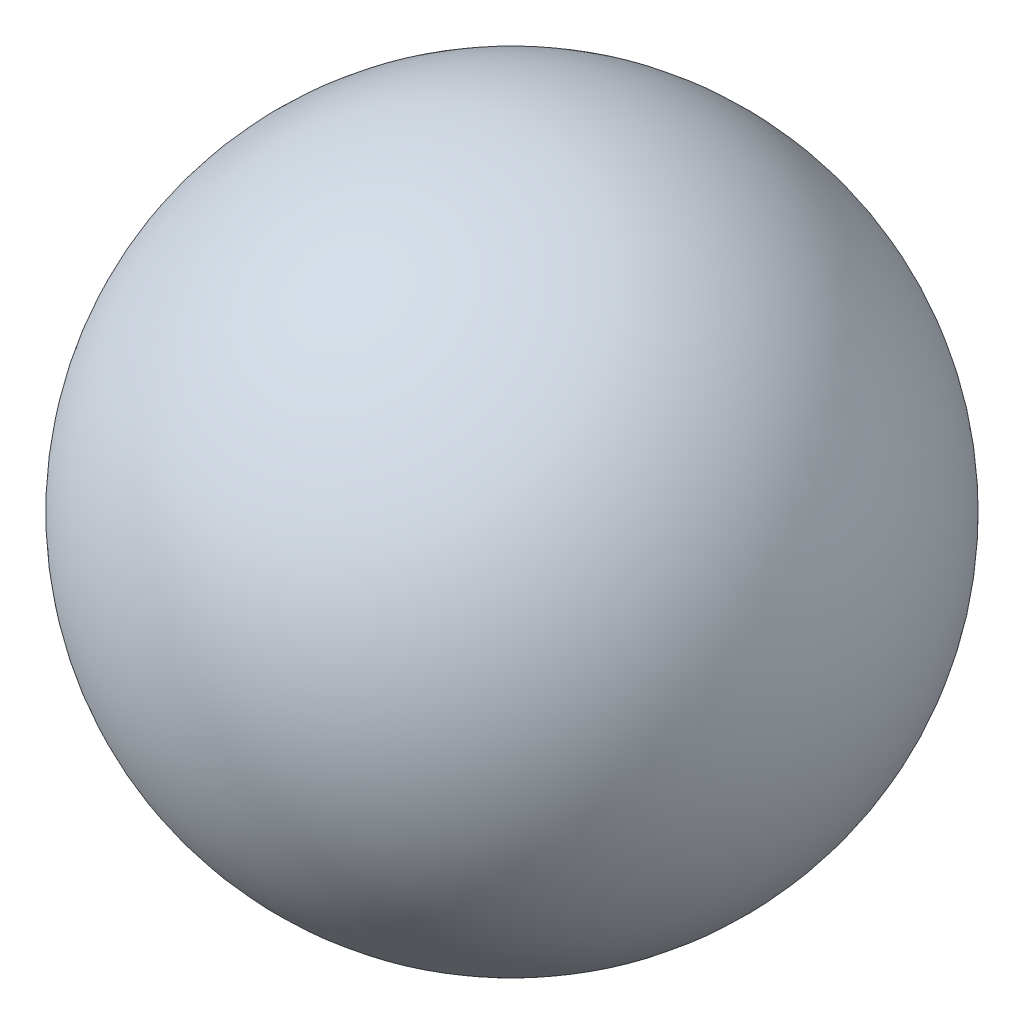
ISO-10303-21;
HEADER;
FILE_DESCRIPTION(('STEP AP214'),'2;1');
FILE_NAME('part.step','',(''),(''),'','','');
FILE_SCHEMA(('AUTOMOTIVE_DESIGN { 1 0 10303 214 1 1 1 1 }'));
ENDSEC;
DATA;
#1=APPLICATION_CONTEXT('core data for automotive mechanical design processes');
#2=APPLICATION_PROTOCOL_DEFINITION('international standard','automotive_design',2000,#1);
#3=PRODUCT_CONTEXT('',#1,'mechanical');
#4=PRODUCT('Part','Part','',(#3));
#5=PRODUCT_RELATED_PRODUCT_CATEGORY('part','',(#4));
#6=PRODUCT_DEFINITION_FORMATION('','',#4);
#7=PRODUCT_DEFINITION_CONTEXT('part definition',#1,'design');
#8=PRODUCT_DEFINITION('design','',#6,#7);
#9=PRODUCT_DEFINITION_SHAPE('','',#8);
#10=(LENGTH_UNIT() NAMED_UNIT(*) SI_UNIT(.MILLI.,.METRE.));
#11=(NAMED_UNIT(*) PLANE_ANGLE_UNIT() SI_UNIT($,.RADIAN.));
#12=(NAMED_UNIT(*) SI_UNIT($,.STERADIAN.) SOLID_ANGLE_UNIT());
#13=UNCERTAINTY_MEASURE_WITH_UNIT(LENGTH_MEASURE(1.E-05),#10,'distance_accuracy_value','');
#14=(GEOMETRIC_REPRESENTATION_CONTEXT(3) GLOBAL_UNCERTAINTY_ASSIGNED_CONTEXT((#13)) GLOBAL_UNIT_ASSIGNED_CONTEXT((#10,
#11,#12)) REPRESENTATION_CONTEXT('',''));
#15=CARTESIAN_POINT('',(0.,0.,0.));
#16=DIRECTION('',(0.,0.,1.));
#17=DIRECTION('',(1.,0.,0.));
#18=AXIS2_PLACEMENT_3D('',#15,#16,#17);
#19=CARTESIAN_POINT('',(0.,0.,0.));
#20=DIRECTION('',(0.,-1.,0.));
#21=DIRECTION('',(-1.,0.,0.));
#22=AXIS2_PLACEMENT_3D('',#19,#20,#21);
#23=SPHERICAL_SURFACE('',#22,300.);
#24=CARTESIAN_POINT('',(0.,-300.,0.));
#25=VERTEX_POINT('',#24);
#26=VERTEX_LOOP('',#25);
#27=FACE_BOUND('',#26,.T.);
#28=ADVANCED_FACE('F30',(#27),#23,.T.);
#29=CLOSED_SHELL('',(#28));
#30=MANIFOLD_SOLID_BREP('B2',#29);
#31=ADVANCED_BREP_SHAPE_REPRESENTATION('',(#18,#30),#14);
#32=SHAPE_DEFINITION_REPRESENTATION(#9,#31);
ENDSEC;
END-ISO-10303-21;
